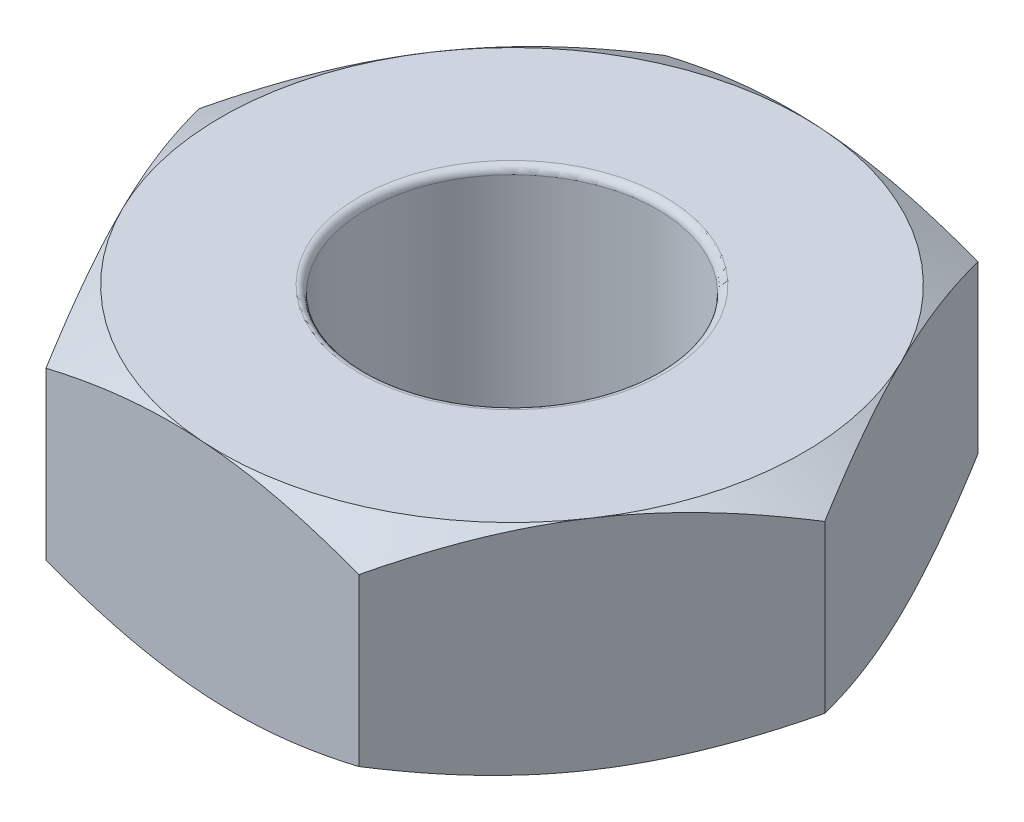
ISO-10303-21;
HEADER;
FILE_DESCRIPTION(('STEP AP214'),'2;1');
FILE_NAME('part.step','',(''),(''),'','','');
FILE_SCHEMA(('AUTOMOTIVE_DESIGN { 1 0 10303 214 1 1 1 1 }'));
ENDSEC;
DATA;
#1=APPLICATION_CONTEXT('core data for automotive mechanical design processes');
#2=APPLICATION_PROTOCOL_DEFINITION('international standard','automotive_design',2000,#1);
#3=PRODUCT_CONTEXT('',#1,'mechanical');
#4=PRODUCT('Part','Part','',(#3));
#5=PRODUCT_RELATED_PRODUCT_CATEGORY('part','',(#4));
#6=PRODUCT_DEFINITION_FORMATION('','',#4);
#7=PRODUCT_DEFINITION_CONTEXT('part definition',#1,'design');
#8=PRODUCT_DEFINITION('design','',#6,#7);
#9=PRODUCT_DEFINITION_SHAPE('','',#8);
#10=(LENGTH_UNIT() NAMED_UNIT(*) SI_UNIT(.MILLI.,.METRE.));
#11=(NAMED_UNIT(*) PLANE_ANGLE_UNIT() SI_UNIT($,.RADIAN.));
#12=(NAMED_UNIT(*) SI_UNIT($,.STERADIAN.) SOLID_ANGLE_UNIT());
#13=UNCERTAINTY_MEASURE_WITH_UNIT(LENGTH_MEASURE(1.E-05),#10,'distance_accuracy_value','');
#14=(GEOMETRIC_REPRESENTATION_CONTEXT(3) GLOBAL_UNCERTAINTY_ASSIGNED_CONTEXT((#13)) GLOBAL_UNIT_ASSIGNED_CONTEXT((#10,
#11,#12)) REPRESENTATION_CONTEXT('',''));
#15=CARTESIAN_POINT('',(0.,0.,0.));
#16=DIRECTION('',(0.,0.,1.));
#17=DIRECTION('',(1.,0.,0.));
#18=AXIS2_PLACEMENT_3D('',#15,#16,#17);
#19=CARTESIAN_POINT('',(-1.01889145115378,1.5,-2.07248487186254));
#20=DIRECTION('',(0.830790431180641,0.,0.556585356848961));
#21=DIRECTION('',(0.556585356848961,0.,-0.830790431180641));
#22=AXIS2_PLACEMENT_3D('',#19,#20,#21);
#23=PLANE('',#22);
#24=CARTESIAN_POINT('',(-2.3044042629206,0.17870229447922,-0.153656555533305));
#25=CARTESIAN_POINT('',(-2.24791738690639,0.149392131732598,-0.237972025752594));
#26=CARTESIAN_POINT('',(-2.19094292197888,0.122735200947277,-0.32301529845274));
#27=CARTESIAN_POINT('',(-2.07600733306594,0.0762043280336535,-0.494574586342692));
#28=CARTESIAN_POINT('',(-2.01804416619686,0.0563468484288385,-0.581093650854886));
#29=CARTESIAN_POINT('',(-1.90283620884368,0.0254345122474909,-0.753059491111205));
#30=CARTESIAN_POINT('',(-1.84560914882281,0.0141739393697929,-0.838479801374307));
#31=CARTESIAN_POINT('',(-1.73088563126617,0.000728946954070537,-1.00972253969756));
#32=CARTESIAN_POINT('',(-1.67338959097216,-0.00146660385901551,-1.09554434495932));
#33=CARTESIAN_POINT('',(-1.56594674731313,0.00309064611007184,-1.25591954224462));
#34=CARTESIAN_POINT('',(-1.51598389446592,0.00872448434658641,-1.33049689062285));
#35=CARTESIAN_POINT('',(-1.41638371049122,0.0265836323047187,-1.47916569545537));
#36=CARTESIAN_POINT('',(-1.36674672409494,0.0388150480780434,-1.55325663734456));
#37=CARTESIAN_POINT('',(-1.26694103244785,0.0693938952955361,-1.70223219442209));
#38=CARTESIAN_POINT('',(-1.21678496505558,0.0878710038893823,-1.77709794563597));
#39=CARTESIAN_POINT('',(-1.11722107773823,0.129807255614723,-1.9257125720478));
#40=CARTESIAN_POINT('',(-1.0678119813515,0.153256539361942,-1.99946335256378));
#41=CARTESIAN_POINT('',(-1.01875746180196,0.17870229447922,-2.07268487186254));
#42=B_SPLINE_CURVE_WITH_KNOTS('',3,(#24,#25,#26,#27,#28,#29,#30,#31,#32,#33,#34,#35,#36,#37,#38,
#39,#40,#41),.UNSPECIFIED.,.F.,.F.,(4,2,2,2,2,2,2,2,4),(0.,0.317032495401926,0.634827236126451,
0.944755934056078,1.25430394571055,1.52387737299583,1.79370071938297,2.06951074204568,
2.34477888847632),.UNSPECIFIED.);
#43=CARTESIAN_POINT('',(-2.30427027356878,0.178632794954081,-0.153856555533305));
#44=VERTEX_POINT('',#43);
#45=CARTESIAN_POINT('',(-1.66158086236128,0.,-1.11317071369792));
#46=VERTEX_POINT('',#45);
#47=EDGE_CURVE('E67',#44,#46,#42,.T.);
#48=ORIENTED_EDGE('',*,*,#47,.F.);
#49=DIRECTION('',(0.,-1.,0.));
#50=VECTOR('',#49,1.);
#51=CARTESIAN_POINT('',(-2.30427027356878,1.5,-0.153856555533305));
#52=LINE('',#51,#50);
#53=CARTESIAN_POINT('',(-2.30427027356878,1.32136720504592,-0.153856555533305));
#54=VERTEX_POINT('',#53);
#55=EDGE_CURVE('E301',#54,#44,#52,.T.);
#56=ORIENTED_EDGE('',*,*,#55,.F.);
#57=CARTESIAN_POINT('',(-1.01875746180196,1.32129770552078,-2.07268487186254));
#58=CARTESIAN_POINT('',(-1.07524433781617,1.3506078682674,-1.98836940164325));
#59=CARTESIAN_POINT('',(-1.13221880274368,1.37726479905272,-1.9033261289431));
#60=CARTESIAN_POINT('',(-1.24715439165662,1.42379567196635,-1.73176684105315));
#61=CARTESIAN_POINT('',(-1.3051175585257,1.44365315157116,-1.64524777654096));
#62=CARTESIAN_POINT('',(-1.42032551587889,1.47456548775251,-1.47328193628464));
#63=CARTESIAN_POINT('',(-1.47755257589975,1.48582606063021,-1.38786162602154));
#64=CARTESIAN_POINT('',(-1.59227609345639,1.49927105304593,-1.21661888769829));
#65=CARTESIAN_POINT('',(-1.6497721337504,1.50146660385902,-1.13079708243652));
#66=CARTESIAN_POINT('',(-1.75721497740943,1.49690935388993,-0.970421885151226));
#67=CARTESIAN_POINT('',(-1.80717783025664,1.49127551565341,-0.895844536772995));
#68=CARTESIAN_POINT('',(-1.90677801423135,1.47341636769528,-0.747175731940476));
#69=CARTESIAN_POINT('',(-1.95641500062762,1.46118495192196,-0.673084790051286));
#70=CARTESIAN_POINT('',(-2.05622069227472,1.43060610470446,-0.524109232973755));
#71=CARTESIAN_POINT('',(-2.10637675966698,1.41212899611062,-0.449243481759878));
#72=CARTESIAN_POINT('',(-2.20594064698433,1.37019274438528,-0.300628855348047));
#73=CARTESIAN_POINT('',(-2.25534974337106,1.34674346063806,-0.22687807483206));
#74=CARTESIAN_POINT('',(-2.3044042629206,1.32129770552078,-0.153656555533305));
#75=B_SPLINE_CURVE_WITH_KNOTS('',3,(#57,#58,#59,#60,#61,#62,#63,#64,#65,#66,#67,#68,#69,#70,#71,
#72,#73,#74),.UNSPECIFIED.,.F.,.F.,(4,2,2,2,2,2,2,2,4),(0.,0.317032495401926,0.634827236126451,
0.944755934056078,1.25430394571055,1.52387737299583,1.79370071938297,2.06951074204568,
2.34477888847632),.UNSPECIFIED.);
#76=CARTESIAN_POINT('',(-1.66158086236128,1.5,-1.11317071369792));
#77=VERTEX_POINT('',#76);
#78=EDGE_CURVE('E281',#77,#54,#75,.T.);
#79=ORIENTED_EDGE('',*,*,#78,.F.);
#80=CARTESIAN_POINT('',(-1.01889145115378,1.32136720504592,-2.07248487186254));
#81=VERTEX_POINT('',#80);
#82=EDGE_CURVE('E287',#81,#77,#75,.T.);
#83=ORIENTED_EDGE('',*,*,#82,.F.);
#84=DIRECTION('',(0.,-1.,0.));
#85=VECTOR('',#84,1.);
#86=CARTESIAN_POINT('',(-1.01889145115378,1.5,-2.07248487186254));
#87=LINE('',#86,#85);
#88=CARTESIAN_POINT('',(-1.01889145115378,0.178632794954081,-2.07248487186254));
#89=VERTEX_POINT('',#88);
#90=EDGE_CURVE('E289',#81,#89,#87,.T.);
#91=ORIENTED_EDGE('',*,*,#90,.T.);
#92=EDGE_CURVE('E182',#46,#89,#42,.T.);
#93=ORIENTED_EDGE('',*,*,#92,.F.);
#94=EDGE_LOOP('',(#48,#56,#79,#83,#91,#93));
#95=FACE_BOUND('',#94,.T.);
#96=ADVANCED_FACE('F44',(#95),#23,.F.);
#97=CARTESIAN_POINT('',(-2.30427027356878,1.5,-0.153856555533305));
#98=DIRECTION('',(0.897412273995947,0.,-0.441192940198982));
#99=DIRECTION('',(-0.441192940198982,0.,-0.897412273995948));
#100=AXIS2_PLACEMENT_3D('',#97,#98,#99);
#101=PLANE('',#100);
#102=CARTESIAN_POINT('',(-1.28528049682865,0.178697134619441,1.91882831632923));
#103=CARTESIAN_POINT('',(-1.33005626488278,0.149387395607351,1.82775178230482));
#104=CARTESIAN_POINT('',(-1.37521853306385,0.122730914901557,1.73588908439103));
#105=CARTESIAN_POINT('',(-1.46632515914288,0.0762009761286628,1.55057287228482));
#106=CARTESIAN_POINT('',(-1.5122711363043,0.0563439799977001,1.45711606441569));
#107=CARTESIAN_POINT('',(-1.6035936553284,0.025432599611697,1.27136071341778));
#108=CARTESIAN_POINT('',(-1.64895614323008,0.0141725019713579,1.17909075686862));
#109=CARTESIAN_POINT('',(-1.73989464820186,0.000728428109246974,0.994116512938719));
#110=CARTESIAN_POINT('',(-1.78547033456643,-0.0014666789988339,0.90141289823239));
#111=CARTESIAN_POINT('',(-1.87063657506906,0.00309127237815013,0.728179778222175));
#112=CARTESIAN_POINT('',(-1.91023985538118,0.00872519658883831,0.64762438713508));
#113=CARTESIAN_POINT('',(-1.98918839151325,0.0265841121102571,0.48703844188631));
#114=CARTESIAN_POINT('',(-2.02853337410976,0.0388152085484475,0.407008443477135));
#115=CARTESIAN_POINT('',(-2.10764478788152,0.0693930588229366,0.246091195572109));
#116=CARTESIAN_POINT('',(-2.14740120233765,0.0878694769760539,0.165224320669449));
#117=CARTESIAN_POINT('',(-2.22632095251759,0.129804085459463,0.00469692773285772));
#118=CARTESIAN_POINT('',(-2.26548529992143,0.153252417709535,-0.0749656481175029));
#119=CARTESIAN_POINT('',(-2.30436859915514,0.17869713461944,-0.154056555533305));
#120=B_SPLINE_CURVE_WITH_KNOTS('',3,(#102,#103,#104,#105,#106,#107,#108,#109,#110,#111,#112,
#113,#114,#115,#116,#117,#118,#119),.UNSPECIFIED.,.F.,.F.,(4,2,2,2,2,2,2,2,4),(0.,
0.317031271595703,0.63482475500014,0.944752346052572,1.25429926418656,1.52386478275026,
1.79368019058361,2.06948185449797,2.34474170148875),.UNSPECIFIED.);
#121=CARTESIAN_POINT('',(-1.28537882241501,0.178632794954081,1.91862831632923));
#122=VERTEX_POINT('',#121);
#123=CARTESIAN_POINT('',(-1.7948245479919,0.,0.882385880397964));
#124=VERTEX_POINT('',#123);
#125=EDGE_CURVE('E172',#122,#124,#120,.T.);
#126=ORIENTED_EDGE('',*,*,#125,.F.);
#127=DIRECTION('',(0.,-1.,0.));
#128=VECTOR('',#127,1.);
#129=CARTESIAN_POINT('',(-1.28537882241501,1.5,1.91862831632923));
#130=LINE('',#129,#128);
#131=CARTESIAN_POINT('',(-1.28537882241501,1.32136720504592,1.91862831632923));
#132=VERTEX_POINT('',#131);
#133=EDGE_CURVE('E298',#132,#122,#130,.T.);
#134=ORIENTED_EDGE('',*,*,#133,.F.);
#135=CARTESIAN_POINT('',(-2.30436859915514,1.32130286538056,-0.154056555533305));
#136=CARTESIAN_POINT('',(-2.25959283110101,1.35061260439265,-0.0629800215088912));
#137=CARTESIAN_POINT('',(-2.21443056291994,1.37726908509844,0.0288826764049017));
#138=CARTESIAN_POINT('',(-2.12332393684091,1.42379902387134,0.214198888511105));
#139=CARTESIAN_POINT('',(-2.07737795967949,1.4436560200023,0.307655696380241));
#140=CARTESIAN_POINT('',(-1.98605544065539,1.4745674003883,0.493411047378148));
#141=CARTESIAN_POINT('',(-1.94069295275371,1.48582749802864,0.585681003927309));
#142=CARTESIAN_POINT('',(-1.84975444778193,1.49927157189075,0.770655247857208));
#143=CARTESIAN_POINT('',(-1.80417876141736,1.50146667899883,0.863358862563537));
#144=CARTESIAN_POINT('',(-1.71901252091473,1.49690872762185,1.03659198257375));
#145=CARTESIAN_POINT('',(-1.67940924060262,1.49127480341116,1.11714737366085));
#146=CARTESIAN_POINT('',(-1.60046070447054,1.47341588788974,1.27773331890962));
#147=CARTESIAN_POINT('',(-1.56111572187403,1.46118479145155,1.35776331731879));
#148=CARTESIAN_POINT('',(-1.48200430810227,1.43060694117706,1.51868056522382));
#149=CARTESIAN_POINT('',(-1.44224789364614,1.41213052302395,1.59954744012648));
#150=CARTESIAN_POINT('',(-1.3633281434662,1.37019591454054,1.76007483306307));
#151=CARTESIAN_POINT('',(-1.32416379606236,1.34674758229047,1.83973740891343));
#152=CARTESIAN_POINT('',(-1.28528049682865,1.32130286538056,1.91882831632923));
#153=B_SPLINE_CURVE_WITH_KNOTS('',3,(#135,#136,#137,#138,#139,#140,#141,#142,#143,#144,#145,
#146,#147,#148,#149,#150,#151,#152),.UNSPECIFIED.,.F.,.F.,(4,2,2,2,2,2,2,2,4),(0.,
0.317031271595703,0.634824755000139,0.944752346052571,1.25429926418656,1.52386478275026,
1.79368019058361,2.06948185449797,2.34474170148875),.UNSPECIFIED.);
#154=CARTESIAN_POINT('',(-1.7948245479919,1.5,0.882385880397964));
#155=VERTEX_POINT('',#154);
#156=EDGE_CURVE('E260',#155,#132,#153,.T.);
#157=ORIENTED_EDGE('',*,*,#156,.F.);
#158=EDGE_CURVE('E288',#54,#155,#153,.T.);
#159=ORIENTED_EDGE('',*,*,#158,.F.);
#160=ORIENTED_EDGE('',*,*,#55,.T.);
#161=EDGE_CURVE('E146',#124,#44,#120,.T.);
#162=ORIENTED_EDGE('',*,*,#161,.F.);
#163=EDGE_LOOP('',(#126,#134,#157,#159,#160,#162));
#164=FACE_BOUND('',#163,.T.);
#165=ADVANCED_FACE('F269',(#164),#101,.F.);
#166=CARTESIAN_POINT('',(-1.28537882241501,1.5,1.91862831632923));
#167=DIRECTION('',(0.0666218428153071,0.,-0.997778297047943));
#168=DIRECTION('',(-0.997778297047943,0.,-0.0666218428153071));
#169=AXIS2_PLACEMENT_3D('',#166,#167,#168);
#170=PLANE('',#169);
#171=CARTESIAN_POINT('',(1.01909145115378,0.178690662303247,2.07249822589981));
#172=CARTESIAN_POINT('',(0.917829352494562,0.149381454814434,2.06573693670362));
#173=CARTESIAN_POINT('',(0.81569316829451,0.122725538678633,2.05891728465299));
#174=CARTESIAN_POINT('',(0.609652105069073,0.0761967716707326,2.04515988446869));
#175=CARTESIAN_POINT('',(0.505743564246356,0.0563403819980083,2.03822189183611));
#176=CARTESIAN_POINT('',(0.299214270424286,0.0254302005380428,2.0244318924039));
#177=CARTESIAN_POINT('',(0.196625299446483,0.0141706990231682,2.01758200769575));
#178=CARTESIAN_POINT('',(-0.00903550238193889,0.000727777368869983,2.00384999763578));
#179=CARTESIAN_POINT('',(-0.112106585419752,-0.00146677316922905,1.99696792221555));
#180=CARTESIAN_POINT('',(-0.30471020786291,0.00309205800416933,1.98410774245615));
#181=CARTESIAN_POINT('',(-0.3942715397437,0.00872609003739609,1.97812771563803));
#182=CARTESIAN_POINT('',(-0.572810695809223,0.0265847139710575,1.96620662291937));
#183=CARTESIAN_POINT('',(-0.661787902192491,0.0388154098397373,1.96026559826955));
#184=CARTESIAN_POINT('',(-0.840695346194219,0.0693920095804895,1.94831991489677));
#185=CARTESIAN_POINT('',(-0.930602933467215,0.0878675616733848,1.94231676854158));
#186=CARTESIAN_POINT('',(-1.10907694794356,0.129800108944276,1.93040002533897));
#187=CARTESIAN_POINT('',(-1.19764566270271,0.15324724767766,1.92448627575102));
#188=CARTESIAN_POINT('',(-1.28557882241501,0.178690662303247,1.91861496229197));
#189=B_SPLINE_CURVE_WITH_KNOTS('',3,(#171,#172,#173,#174,#175,#176,#177,#178,#179,#180,#181,
#182,#183,#184,#185,#186,#187,#188),.UNSPECIFIED.,.F.,.F.,(4,2,2,2,2,2,2,2,4),(0.,
0.317029736502206,0.634821642774693,0.944747845406166,1.25429339187313,1.52384898991189,
1.79365443980244,2.0694456187155,2.34469505509446),.UNSPECIFIED.);
#190=CARTESIAN_POINT('',(1.01889145115378,0.178632794954081,2.07248487186254));
#191=VERTEX_POINT('',#190);
#192=CARTESIAN_POINT('',(-0.133243685630614,0.,1.99555659409589));
#193=VERTEX_POINT('',#192);
#194=EDGE_CURVE('E155',#191,#193,#189,.T.);
#195=ORIENTED_EDGE('',*,*,#194,.F.);
#196=DIRECTION('',(0.,-1.,0.));
#197=VECTOR('',#196,1.);
#198=CARTESIAN_POINT('',(1.01889145115378,1.5,2.07248487186254));
#199=LINE('',#198,#197);
#200=CARTESIAN_POINT('',(1.01889145115378,1.32136720504592,2.07248487186254));
#201=VERTEX_POINT('',#200);
#202=EDGE_CURVE('E170',#201,#191,#199,.T.);
#203=ORIENTED_EDGE('',*,*,#202,.F.);
#204=CARTESIAN_POINT('',(-1.28557882241501,1.32130933769675,1.91861496229197));
#205=CARTESIAN_POINT('',(-1.18431672375579,1.35061854518557,1.92537625148815));
#206=CARTESIAN_POINT('',(-1.08218053955574,1.37727446132137,1.93219590353878));
#207=CARTESIAN_POINT('',(-0.876139476330302,1.42380322832927,1.94595330372308));
#208=CARTESIAN_POINT('',(-0.772230935507585,1.44365961800199,1.95289129635566));
#209=CARTESIAN_POINT('',(-0.565701641685515,1.47456979946196,1.96668129578787));
#210=CARTESIAN_POINT('',(-0.463112670707712,1.48582930097683,1.97353118049602));
#211=CARTESIAN_POINT('',(-0.25745186887929,1.49927222263113,1.98726319055599));
#212=CARTESIAN_POINT('',(-0.154380785841477,1.50146677316923,1.99414526597622));
#213=CARTESIAN_POINT('',(0.0382228366016809,1.49690794199583,2.00700544573562));
#214=CARTESIAN_POINT('',(0.127784168482471,1.4912739099626,2.01298547255375));
#215=CARTESIAN_POINT('',(0.306323324547994,1.47341528602894,2.0249065652724));
#216=CARTESIAN_POINT('',(0.395300530931262,1.46118459016026,2.03084758992222));
#217=CARTESIAN_POINT('',(0.57420797493299,1.43060799041951,2.042793273295));
#218=CARTESIAN_POINT('',(0.664115562205986,1.41213243832662,2.04879641965019));
#219=CARTESIAN_POINT('',(0.842589576682329,1.37019989105572,2.0607131628528));
#220=CARTESIAN_POINT('',(0.931158291441481,1.34675275232234,2.06662691244076));
#221=CARTESIAN_POINT('',(1.01909145115378,1.32130933769675,2.07249822589981));
#222=B_SPLINE_CURVE_WITH_KNOTS('',3,(#204,#205,#206,#207,#208,#209,#210,#211,#212,#213,#214,
#215,#216,#217,#218,#219,#220,#221),.UNSPECIFIED.,.F.,.F.,(4,2,2,2,2,2,2,2,4),(0.,
0.317029736502206,0.634821642774694,0.944747845406166,1.25429339187313,1.52384898991189,
1.79365443980244,2.0694456187155,2.34469505509446),.UNSPECIFIED.);
#223=CARTESIAN_POINT('',(-0.133243685630614,1.5,1.99555659409589));
#224=VERTEX_POINT('',#223);
#225=EDGE_CURVE('E253',#224,#201,#222,.T.);
#226=ORIENTED_EDGE('',*,*,#225,.F.);
#227=EDGE_CURVE('E259',#132,#224,#222,.T.);
#228=ORIENTED_EDGE('',*,*,#227,.F.);
#229=ORIENTED_EDGE('',*,*,#133,.T.);
#230=EDGE_CURVE('E171',#193,#122,#189,.T.);
#231=ORIENTED_EDGE('',*,*,#230,.F.);
#232=EDGE_LOOP('',(#195,#203,#226,#228,#229,#231));
#233=FACE_BOUND('',#232,.T.);
#234=ADVANCED_FACE('F266',(#233),#170,.F.);
#235=CARTESIAN_POINT('',(1.01889145115378,1.5,2.07248487186254));
#236=DIRECTION('',(-0.830790431180641,0.,-0.556585356848961));
#237=DIRECTION('',(-0.556585356848961,0.,0.830790431180641));
#238=AXIS2_PLACEMENT_3D('',#235,#236,#237);
#239=PLANE('',#238);
#240=CARTESIAN_POINT('',(2.3044042629206,0.17870229447922,0.153656555533305));
#241=CARTESIAN_POINT('',(2.24791738690639,0.149392131732598,0.237972025752593));
#242=CARTESIAN_POINT('',(2.19094292197888,0.122735200947276,0.32301529845274));
#243=CARTESIAN_POINT('',(2.07600733306594,0.0762043280336534,0.494574586342692));
#244=CARTESIAN_POINT('',(2.01804416619686,0.0563468484288386,0.581093650854885));
#245=CARTESIAN_POINT('',(1.90283620884368,0.0254345122474909,0.753059491111204));
#246=CARTESIAN_POINT('',(1.84560914882281,0.0141739393697926,0.838479801374306));
#247=CARTESIAN_POINT('',(1.73088563126617,0.000728946954070292,1.00972253969756));
#248=CARTESIAN_POINT('',(1.67338959097216,-0.00146660385901551,1.09554434495932));
#249=CARTESIAN_POINT('',(1.56594674731313,0.00309064611007183,1.25591954224462));
#250=CARTESIAN_POINT('',(1.51598389446592,0.00872448434658623,1.33049689062285));
#251=CARTESIAN_POINT('',(1.41638371049121,0.0265836323047185,1.47916569545537));
#252=CARTESIAN_POINT('',(1.36674672409494,0.0388150480780433,1.55325663734456));
#253=CARTESIAN_POINT('',(1.26694103244784,0.0693938952955362,1.70223219442209));
#254=CARTESIAN_POINT('',(1.21678496505558,0.0878710038893824,1.77709794563597));
#255=CARTESIAN_POINT('',(1.11722107773823,0.129807255614723,1.9257125720478));
#256=CARTESIAN_POINT('',(1.0678119813515,0.153256539361942,1.99946335256378));
#257=CARTESIAN_POINT('',(1.01875746180196,0.17870229447922,2.07268487186254));
#258=B_SPLINE_CURVE_WITH_KNOTS('',3,(#240,#241,#242,#243,#244,#245,#246,#247,#248,#249,#250,
#251,#252,#253,#254,#255,#256,#257),.UNSPECIFIED.,.F.,.F.,(4,2,2,2,2,2,2,2,4),(0.,
0.317032495401926,0.634827236126451,0.944755934056078,1.25430394571055,1.52387737299583,
1.79370071938297,2.06951074204568,2.34477888847632),.UNSPECIFIED.);
#259=CARTESIAN_POINT('',(2.30427027356878,0.178632794954081,0.153856555533305));
#260=VERTEX_POINT('',#259);
#261=CARTESIAN_POINT('',(1.66158086236128,0.,1.11317071369792));
#262=VERTEX_POINT('',#261);
#263=EDGE_CURVE('E134',#260,#262,#258,.T.);
#264=ORIENTED_EDGE('',*,*,#263,.F.);
#265=DIRECTION('',(0.,-1.,0.));
#266=VECTOR('',#265,1.);
#267=CARTESIAN_POINT('',(2.30427027356878,1.5,0.153856555533305));
#268=LINE('',#267,#266);
#269=CARTESIAN_POINT('',(2.30427027356878,1.32136720504592,0.153856555533305));
#270=VERTEX_POINT('',#269);
#271=EDGE_CURVE('E295',#270,#260,#268,.T.);
#272=ORIENTED_EDGE('',*,*,#271,.F.);
#273=CARTESIAN_POINT('',(1.01875746180196,1.32129770552078,2.07268487186254));
#274=CARTESIAN_POINT('',(1.07524433781617,1.3506078682674,1.98836940164325));
#275=CARTESIAN_POINT('',(1.13221880274368,1.37726479905272,1.9033261289431));
#276=CARTESIAN_POINT('',(1.24715439165662,1.42379567196635,1.73176684105315));
#277=CARTESIAN_POINT('',(1.3051175585257,1.44365315157116,1.64524777654096));
#278=CARTESIAN_POINT('',(1.42032551587889,1.47456548775251,1.47328193628464));
#279=CARTESIAN_POINT('',(1.47755257589975,1.48582606063021,1.38786162602154));
#280=CARTESIAN_POINT('',(1.59227609345639,1.49927105304593,1.21661888769829));
#281=CARTESIAN_POINT('',(1.6497721337504,1.50146660385902,1.13079708243652));
#282=CARTESIAN_POINT('',(1.75721497740943,1.49690935388993,0.970421885151226));
#283=CARTESIAN_POINT('',(1.80717783025664,1.49127551565341,0.895844536772995));
#284=CARTESIAN_POINT('',(1.90677801423135,1.47341636769528,0.747175731940476));
#285=CARTESIAN_POINT('',(1.95641500062762,1.46118495192196,0.673084790051286));
#286=CARTESIAN_POINT('',(2.05622069227472,1.43060610470446,0.524109232973755));
#287=CARTESIAN_POINT('',(2.10637675966698,1.41212899611062,0.449243481759878));
#288=CARTESIAN_POINT('',(2.20594064698433,1.37019274438528,0.300628855348046));
#289=CARTESIAN_POINT('',(2.25534974337106,1.34674346063806,0.226878074832059));
#290=CARTESIAN_POINT('',(2.3044042629206,1.32129770552078,0.153656555533305));
#291=B_SPLINE_CURVE_WITH_KNOTS('',3,(#273,#274,#275,#276,#277,#278,#279,#280,#281,#282,#283,
#284,#285,#286,#287,#288,#289,#290),.UNSPECIFIED.,.F.,.F.,(4,2,2,2,2,2,2,2,4),(0.,
0.317032495401926,0.634827236126452,0.944755934056078,1.25430394571055,1.52387737299583,
1.79370071938297,2.06951074204568,2.34477888847632),.UNSPECIFIED.);
#292=CARTESIAN_POINT('',(1.66158086236128,1.5,1.11317071369792));
#293=VERTEX_POINT('',#292);
#294=EDGE_CURVE('E246',#293,#270,#291,.T.);
#295=ORIENTED_EDGE('',*,*,#294,.F.);
#296=EDGE_CURVE('E252',#201,#293,#291,.T.);
#297=ORIENTED_EDGE('',*,*,#296,.F.);
#298=ORIENTED_EDGE('',*,*,#202,.T.);
#299=EDGE_CURVE('E148',#262,#191,#258,.T.);
#300=ORIENTED_EDGE('',*,*,#299,.F.);
#301=EDGE_LOOP('',(#264,#272,#295,#297,#298,#300));
#302=FACE_BOUND('',#301,.T.);
#303=ADVANCED_FACE('F167',(#302),#239,.F.);
#304=CARTESIAN_POINT('',(2.30427027356878,1.5,0.153856555533305));
#305=DIRECTION('',(-0.897412273995947,0.,0.441192940198982));
#306=DIRECTION('',(0.441192940198982,0.,0.897412273995948));
#307=AXIS2_PLACEMENT_3D('',#304,#305,#306);
#308=PLANE('',#307);
#309=CARTESIAN_POINT('',(1.28528049682865,0.178697134619441,-1.91882831632923));
#310=CARTESIAN_POINT('',(1.33005626488278,0.149387395607351,-1.82775178230482));
#311=CARTESIAN_POINT('',(1.37521853306385,0.122730914901557,-1.73588908439103));
#312=CARTESIAN_POINT('',(1.46632515914288,0.0762009761286628,-1.55057287228482));
#313=CARTESIAN_POINT('',(1.5122711363043,0.0563439799977,-1.45711606441569));
#314=CARTESIAN_POINT('',(1.6035936553284,0.025432599611697,-1.27136071341778));
#315=CARTESIAN_POINT('',(1.64895614323008,0.0141725019713581,-1.17909075686862));
#316=CARTESIAN_POINT('',(1.73989464820186,0.000728428109247289,-0.994116512938719));
#317=CARTESIAN_POINT('',(1.78547033456643,-0.00146667899883358,-0.90141289823239));
#318=CARTESIAN_POINT('',(1.87063657506906,0.00309127237815033,-0.728179778222175));
#319=CARTESIAN_POINT('',(1.91023985538118,0.00872519658883838,-0.647624387135081));
#320=CARTESIAN_POINT('',(1.98918839151325,0.026584112110257,-0.487038441886311));
#321=CARTESIAN_POINT('',(2.02853337410976,0.0388152085484475,-0.407008443477135));
#322=CARTESIAN_POINT('',(2.10764478788152,0.0693930588229366,-0.246091195572109));
#323=CARTESIAN_POINT('',(2.14740120233765,0.087869476976054,-0.16522432066945));
#324=CARTESIAN_POINT('',(2.22632095251759,0.129804085459463,-0.00469692773285803));
#325=CARTESIAN_POINT('',(2.26548529992143,0.153252417709535,0.0749656481175025));
#326=CARTESIAN_POINT('',(2.30436859915514,0.17869713461944,0.154056555533305));
#327=B_SPLINE_CURVE_WITH_KNOTS('',3,(#309,#310,#311,#312,#313,#314,#315,#316,#317,#318,#319,
#320,#321,#322,#323,#324,#325,#326),.UNSPECIFIED.,.F.,.F.,(4,2,2,2,2,2,2,2,4),(0.,
0.317031271595703,0.634824755000139,0.944752346052572,1.25429926418656,1.52386478275026,
1.79368019058361,2.06948185449797,2.34474170148875),.UNSPECIFIED.);
#328=CARTESIAN_POINT('',(1.28537882241501,0.178632794954081,-1.91862831632923));
#329=VERTEX_POINT('',#328);
#330=CARTESIAN_POINT('',(1.7948245479919,0.,-0.882385880397964));
#331=VERTEX_POINT('',#330);
#332=EDGE_CURVE('E59',#329,#331,#327,.T.);
#333=ORIENTED_EDGE('',*,*,#332,.F.);
#334=DIRECTION('',(0.,-1.,0.));
#335=VECTOR('',#334,1.);
#336=CARTESIAN_POINT('',(1.28537882241501,1.5,-1.91862831632923));
#337=LINE('',#336,#335);
#338=CARTESIAN_POINT('',(1.28537882241501,1.32136720504592,-1.91862831632923));
#339=VERTEX_POINT('',#338);
#340=EDGE_CURVE('E292',#339,#329,#337,.T.);
#341=ORIENTED_EDGE('',*,*,#340,.F.);
#342=CARTESIAN_POINT('',(2.30436859915514,1.32130286538056,0.154056555533305));
#343=CARTESIAN_POINT('',(2.25959283110101,1.35061260439265,0.0629800215088903));
#344=CARTESIAN_POINT('',(2.21443056291994,1.37726908509844,-0.0288826764049024));
#345=CARTESIAN_POINT('',(2.12332393684091,1.42379902387134,-0.214198888511106));
#346=CARTESIAN_POINT('',(2.07737795967949,1.4436560200023,-0.307655696380241));
#347=CARTESIAN_POINT('',(1.98605544065539,1.4745674003883,-0.493411047378148));
#348=CARTESIAN_POINT('',(1.94069295275371,1.48582749802864,-0.585681003927309));
#349=CARTESIAN_POINT('',(1.84975444778193,1.49927157189075,-0.770655247857209));
#350=CARTESIAN_POINT('',(1.80417876141736,1.50146667899883,-0.863358862563538));
#351=CARTESIAN_POINT('',(1.71901252091473,1.49690872762185,-1.03659198257375));
#352=CARTESIAN_POINT('',(1.67940924060262,1.49127480341116,-1.11714737366085));
#353=CARTESIAN_POINT('',(1.60046070447054,1.47341588788974,-1.27773331890962));
#354=CARTESIAN_POINT('',(1.56111572187403,1.46118479145155,-1.35776331731879));
#355=CARTESIAN_POINT('',(1.48200430810227,1.43060694117706,-1.51868056522382));
#356=CARTESIAN_POINT('',(1.44224789364614,1.41213052302395,-1.59954744012648));
#357=CARTESIAN_POINT('',(1.3633281434662,1.37019591454054,-1.76007483306307));
#358=CARTESIAN_POINT('',(1.32416379606236,1.34674758229047,-1.83973740891343));
#359=CARTESIAN_POINT('',(1.28528049682865,1.32130286538056,-1.91882831632923));
#360=B_SPLINE_CURVE_WITH_KNOTS('',3,(#342,#343,#344,#345,#346,#347,#348,#349,#350,#351,#352,
#353,#354,#355,#356,#357,#358,#359),.UNSPECIFIED.,.F.,.F.,(4,2,2,2,2,2,2,2,4),(0.,
0.317031271595703,0.634824755000139,0.944752346052571,1.25429926418656,1.52386478275026,
1.79368019058361,2.06948185449797,2.34474170148875),.UNSPECIFIED.);
#361=CARTESIAN_POINT('',(1.7948245479919,1.5,-0.882385880397964));
#362=VERTEX_POINT('',#361);
#363=EDGE_CURVE('E238',#362,#339,#360,.T.);
#364=ORIENTED_EDGE('',*,*,#363,.F.);
#365=EDGE_CURVE('E244',#270,#362,#360,.T.);
#366=ORIENTED_EDGE('',*,*,#365,.F.);
#367=ORIENTED_EDGE('',*,*,#271,.T.);
#368=EDGE_CURVE('E141',#331,#260,#327,.T.);
#369=ORIENTED_EDGE('',*,*,#368,.F.);
#370=EDGE_LOOP('',(#333,#341,#364,#366,#367,#369));
#371=FACE_BOUND('',#370,.T.);
#372=ADVANCED_FACE('F229',(#371),#308,.F.);
#373=CARTESIAN_POINT('',(1.28537882241501,1.5,-1.91862831632923));
#374=DIRECTION('',(-0.0666218428153071,0.,0.997778297047943));
#375=DIRECTION('',(0.997778297047943,0.,0.0666218428153071));
#376=AXIS2_PLACEMENT_3D('',#373,#374,#375);
#377=PLANE('',#376);
#378=CARTESIAN_POINT('',(-1.01909145115378,0.178690662303247,-2.07249822589981));
#379=CARTESIAN_POINT('',(-0.917829352494563,0.149381454814433,-2.06573693670362));
#380=CARTESIAN_POINT('',(-0.81569316829451,0.122725538678632,-2.05891728465299));
#381=CARTESIAN_POINT('',(-0.609652105069073,0.0761967716707327,-2.04515988446869));
#382=CARTESIAN_POINT('',(-0.505743564246356,0.0563403819980085,-2.03822189183611));
#383=CARTESIAN_POINT('',(-0.299214270424286,0.0254302005380431,-2.0244318924039));
#384=CARTESIAN_POINT('',(-0.196625299446483,0.0141706990231684,-2.01758200769575));
#385=CARTESIAN_POINT('',(0.00903550238193844,0.000727777368869854,-2.00384999763578));
#386=CARTESIAN_POINT('',(0.112106585419752,-0.00146677316922933,-1.99696792221555));
#387=CARTESIAN_POINT('',(0.30471020786291,0.00309205800416912,-1.98410774245615));
#388=CARTESIAN_POINT('',(0.394271539743699,0.00872609003739608,-1.97812771563803));
#389=CARTESIAN_POINT('',(0.572810695809223,0.0265847139710575,-1.96620662291937));
#390=CARTESIAN_POINT('',(0.661787902192491,0.0388154098397371,-1.96026559826955));
#391=CARTESIAN_POINT('',(0.840695346194219,0.0693920095804893,-1.94831991489677));
#392=CARTESIAN_POINT('',(0.930602933467215,0.0878675616733847,-1.94231676854158));
#393=CARTESIAN_POINT('',(1.10907694794356,0.129800108944276,-1.93040002533897));
#394=CARTESIAN_POINT('',(1.19764566270271,0.15324724767766,-1.92448627575102));
#395=CARTESIAN_POINT('',(1.28557882241501,0.178690662303247,-1.91861496229197));
#396=B_SPLINE_CURVE_WITH_KNOTS('',3,(#378,#379,#380,#381,#382,#383,#384,#385,#386,#387,#388,
#389,#390,#391,#392,#393,#394,#395),.UNSPECIFIED.,.F.,.F.,(4,2,2,2,2,2,2,2,4),(0.,
0.317029736502206,0.634821642774693,0.944747845406166,1.25429339187313,1.52384898991189,
1.79365443980244,2.0694456187155,2.34469505509446),.UNSPECIFIED.);
#397=CARTESIAN_POINT('',(0.133243685630614,0.,-1.99555659409588));
#398=VERTEX_POINT('',#397);
#399=EDGE_CURVE('E228',#89,#398,#396,.T.);
#400=ORIENTED_EDGE('',*,*,#399,.F.);
#401=ORIENTED_EDGE('',*,*,#90,.F.);
#402=CARTESIAN_POINT('',(1.28557882241501,1.32130933769675,-1.91861496229197));
#403=CARTESIAN_POINT('',(1.18431672375579,1.35061854518557,-1.92537625148815));
#404=CARTESIAN_POINT('',(1.08218053955574,1.37727446132137,-1.93219590353878));
#405=CARTESIAN_POINT('',(0.876139476330302,1.42380322832927,-1.94595330372308));
#406=CARTESIAN_POINT('',(0.772230935507585,1.44365961800199,-1.95289129635566));
#407=CARTESIAN_POINT('',(0.565701641685515,1.47456979946196,-1.96668129578787));
#408=CARTESIAN_POINT('',(0.463112670707712,1.48582930097683,-1.97353118049602));
#409=CARTESIAN_POINT('',(0.25745186887929,1.49927222263113,-1.98726319055599));
#410=CARTESIAN_POINT('',(0.154380785841477,1.50146677316923,-1.99414526597622));
#411=CARTESIAN_POINT('',(-0.0382228366016809,1.49690794199583,-2.00700544573562));
#412=CARTESIAN_POINT('',(-0.127784168482471,1.4912739099626,-2.01298547255375));
#413=CARTESIAN_POINT('',(-0.306323324547994,1.47341528602894,-2.0249065652724));
#414=CARTESIAN_POINT('',(-0.395300530931262,1.46118459016026,-2.03084758992222));
#415=CARTESIAN_POINT('',(-0.574207974932991,1.43060799041951,-2.042793273295));
#416=CARTESIAN_POINT('',(-0.664115562205986,1.41213243832662,-2.04879641965019));
#417=CARTESIAN_POINT('',(-0.84258957668233,1.37019989105572,-2.0607131628528));
#418=CARTESIAN_POINT('',(-0.931158291441482,1.34675275232234,-2.06662691244076));
#419=CARTESIAN_POINT('',(-1.01909145115378,1.32130933769675,-2.07249822589981));
#420=B_SPLINE_CURVE_WITH_KNOTS('',3,(#402,#403,#404,#405,#406,#407,#408,#409,#410,#411,#412,
#413,#414,#415,#416,#417,#418,#419),.UNSPECIFIED.,.F.,.F.,(4,2,2,2,2,2,2,2,4),(0.,
0.317029736502206,0.634821642774694,0.944747845406166,1.25429339187313,1.52384898991189,
1.79365443980244,2.0694456187155,2.34469505509446),.UNSPECIFIED.);
#421=CARTESIAN_POINT('',(0.133243685630614,1.5,-1.99555659409589));
#422=VERTEX_POINT('',#421);
#423=EDGE_CURVE('E304',#422,#81,#420,.T.);
#424=ORIENTED_EDGE('',*,*,#423,.F.);
#425=EDGE_CURVE('E160',#339,#422,#420,.T.);
#426=ORIENTED_EDGE('',*,*,#425,.F.);
#427=ORIENTED_EDGE('',*,*,#340,.T.);
#428=EDGE_CURVE('E216',#398,#329,#396,.T.);
#429=ORIENTED_EDGE('',*,*,#428,.F.);
#430=EDGE_LOOP('',(#400,#401,#424,#426,#427,#429));
#431=FACE_BOUND('',#430,.T.);
#432=ADVANCED_FACE('F232',(#431),#377,.F.);
#433=CARTESIAN_POINT('',(0.,0.,0.));
#434=DIRECTION('',(0.,1.,0.));
#435=DIRECTION('',(0.,0.,1.));
#436=AXIS2_PLACEMENT_3D('',#433,#434,#435);
#437=PLANE('',#436);
#438=CARTESIAN_POINT('',(0.,0.,0.));
#439=DIRECTION('',(0.,1.,0.));
#440=DIRECTION('',(0.,0.,1.));
#441=AXIS2_PLACEMENT_3D('',#438,#439,#440);
#442=CIRCLE('',#441,1.05);
#443=CARTESIAN_POINT('',(0.,0.,1.05));
#444=VERTEX_POINT('',#443);
#445=EDGE_CURVE('E164',#444,#444,#442,.T.);
#446=ORIENTED_EDGE('',*,*,#445,.T.);
#447=EDGE_LOOP('',(#446));
#448=FACE_BOUND('',#447,.T.);
#449=CARTESIAN_POINT('',(0.,0.,0.));
#450=DIRECTION('',(0.,1.,0.));
#451=DIRECTION('',(0.,0.,1.));
#452=AXIS2_PLACEMENT_3D('',#449,#450,#451);
#453=CIRCLE('',#452,2.);
#454=EDGE_CURVE('E138',#262,#331,#453,.T.);
#455=ORIENTED_EDGE('',*,*,#454,.F.);
#456=EDGE_CURVE('E152',#193,#262,#453,.T.);
#457=ORIENTED_EDGE('',*,*,#456,.F.);
#458=EDGE_CURVE('E159',#124,#193,#453,.T.);
#459=ORIENTED_EDGE('',*,*,#458,.F.);
#460=EDGE_CURVE('E395',#46,#124,#453,.T.);
#461=ORIENTED_EDGE('',*,*,#460,.F.);
#462=EDGE_CURVE('E165',#398,#46,#453,.T.);
#463=ORIENTED_EDGE('',*,*,#462,.F.);
#464=CARTESIAN_POINT('',(0.,0.,0.));
#465=DIRECTION('',(0.,-1.,0.));
#466=DIRECTION('',(0.,0.,-1.));
#467=AXIS2_PLACEMENT_3D('',#464,#465,#466);
#468=CIRCLE('',#467,2.);
#469=EDGE_CURVE('E163',#398,#331,#468,.T.);
#470=ORIENTED_EDGE('',*,*,#469,.T.);
#471=EDGE_LOOP('',(#455,#457,#459,#461,#463,#470));
#472=FACE_BOUND('',#471,.T.);
#473=ADVANCED_FACE('F162',(#448,#472),#437,.F.);
#474=CARTESIAN_POINT('',(0.,1.5,0.));
#475=DIRECTION('',(0.,1.,0.));
#476=DIRECTION('',(0.,0.,1.));
#477=AXIS2_PLACEMENT_3D('',#474,#475,#476);
#478=PLANE('',#477);
#479=CARTESIAN_POINT('',(0.,1.5,0.));
#480=DIRECTION('',(0.,1.,0.));
#481=DIRECTION('',(0.,0.,1.));
#482=AXIS2_PLACEMENT_3D('',#479,#480,#481);
#483=CIRCLE('',#482,1.05);
#484=CARTESIAN_POINT('',(0.,1.5,1.05));
#485=VERTEX_POINT('',#484);
#486=EDGE_CURVE('E12',#485,#485,#483,.F.);
#487=ORIENTED_EDGE('',*,*,#486,.T.);
#488=EDGE_LOOP('',(#487));
#489=FACE_BOUND('',#488,.T.);
#490=CARTESIAN_POINT('',(0.,1.5,0.));
#491=DIRECTION('',(0.,1.,0.));
#492=DIRECTION('',(0.,0.,1.));
#493=AXIS2_PLACEMENT_3D('',#490,#491,#492);
#494=CIRCLE('',#493,2.);
#495=EDGE_CURVE('E385',#224,#293,#494,.T.);
#496=ORIENTED_EDGE('',*,*,#495,.T.);
#497=EDGE_CURVE('E245',#293,#362,#494,.T.);
#498=ORIENTED_EDGE('',*,*,#497,.T.);
#499=EDGE_CURVE('E381',#362,#422,#494,.T.);
#500=ORIENTED_EDGE('',*,*,#499,.T.);
#501=EDGE_CURVE('E375',#422,#77,#494,.T.);
#502=ORIENTED_EDGE('',*,*,#501,.T.);
#503=EDGE_CURVE('E358',#77,#155,#494,.T.);
#504=ORIENTED_EDGE('',*,*,#503,.T.);
#505=EDGE_CURVE('E386',#155,#224,#494,.T.);
#506=ORIENTED_EDGE('',*,*,#505,.T.);
#507=EDGE_LOOP('',(#496,#498,#500,#502,#504,#506));
#508=FACE_BOUND('',#507,.T.);
#509=ADVANCED_FACE('F325',(#489,#508),#478,.T.);
#510=CARTESIAN_POINT('',(0.,1.5,0.));
#511=DIRECTION('',(0.,-1.,0.));
#512=DIRECTION('',(0.,0.,-1.));
#513=AXIS2_PLACEMENT_3D('',#510,#511,#512);
#514=CYLINDRICAL_SURFACE('',#513,1.);
#515=CARTESIAN_POINT('',(0.,0.0499999999999999,0.));
#516=DIRECTION('',(0.,1.,0.));
#517=DIRECTION('',(0.,0.,1.));
#518=AXIS2_PLACEMENT_3D('',#515,#516,#517);
#519=CIRCLE('',#518,1.);
#520=CARTESIAN_POINT('',(0.,0.0499999999999999,1.));
#521=VERTEX_POINT('',#520);
#522=EDGE_CURVE('E52',#521,#521,#519,.F.);
#523=ORIENTED_EDGE('',*,*,#522,.T.);
#524=EDGE_LOOP('',(#523));
#525=FACE_BOUND('',#524,.T.);
#526=CARTESIAN_POINT('',(0.,1.45,0.));
#527=DIRECTION('',(0.,1.,0.));
#528=DIRECTION('',(0.,0.,1.));
#529=AXIS2_PLACEMENT_3D('',#526,#527,#528);
#530=CIRCLE('',#529,1.);
#531=CARTESIAN_POINT('',(0.,1.45,1.));
#532=VERTEX_POINT('',#531);
#533=EDGE_CURVE('E312',#532,#532,#530,.T.);
#534=ORIENTED_EDGE('',*,*,#533,.T.);
#535=EDGE_LOOP('',(#534));
#536=FACE_BOUND('',#535,.T.);
#537=ADVANCED_FACE('F317',(#525,#536),#514,.F.);
#538=CARTESIAN_POINT('',(0.,1.5,0.));
#539=DIRECTION('',(0.,-1.,0.));
#540=DIRECTION('',(0.,0.,1.));
#541=AXIS2_PLACEMENT_3D('',#538,#539,#540);
#542=CONICAL_SURFACE('',#541,2.,1.0471975511966);
#543=ORIENTED_EDGE('',*,*,#82,.T.);
#544=ORIENTED_EDGE('',*,*,#501,.F.);
#545=ORIENTED_EDGE('',*,*,#423,.T.);
#546=EDGE_LOOP('',(#543,#544,#545));
#547=FACE_BOUND('',#546,.T.);
#548=ADVANCED_FACE('F203',(#547),#542,.T.);
#549=ORIENTED_EDGE('',*,*,#363,.T.);
#550=ORIENTED_EDGE('',*,*,#425,.T.);
#551=ORIENTED_EDGE('',*,*,#499,.F.);
#552=EDGE_LOOP('',(#549,#550,#551));
#553=FACE_BOUND('',#552,.T.);
#554=ADVANCED_FACE('F337',(#553),#542,.T.);
#555=ORIENTED_EDGE('',*,*,#294,.T.);
#556=ORIENTED_EDGE('',*,*,#365,.T.);
#557=ORIENTED_EDGE('',*,*,#497,.F.);
#558=EDGE_LOOP('',(#555,#556,#557));
#559=FACE_BOUND('',#558,.T.);
#560=ADVANCED_FACE('F342',(#559),#542,.T.);
#561=ORIENTED_EDGE('',*,*,#225,.T.);
#562=ORIENTED_EDGE('',*,*,#296,.T.);
#563=ORIENTED_EDGE('',*,*,#495,.F.);
#564=EDGE_LOOP('',(#561,#562,#563));
#565=FACE_BOUND('',#564,.T.);
#566=ADVANCED_FACE('F351',(#565),#542,.T.);
#567=ORIENTED_EDGE('',*,*,#156,.T.);
#568=ORIENTED_EDGE('',*,*,#227,.T.);
#569=ORIENTED_EDGE('',*,*,#505,.F.);
#570=EDGE_LOOP('',(#567,#568,#569));
#571=FACE_BOUND('',#570,.T.);
#572=ADVANCED_FACE('F346',(#571),#542,.T.);
#573=ORIENTED_EDGE('',*,*,#78,.T.);
#574=ORIENTED_EDGE('',*,*,#158,.T.);
#575=ORIENTED_EDGE('',*,*,#503,.F.);
#576=EDGE_LOOP('',(#573,#574,#575));
#577=FACE_BOUND('',#576,.T.);
#578=ADVANCED_FACE('F201',(#577),#542,.T.);
#579=CARTESIAN_POINT('',(0.,0.,0.));
#580=DIRECTION('',(0.,1.,0.));
#581=DIRECTION('',(0.,0.,-1.));
#582=AXIS2_PLACEMENT_3D('',#579,#580,#581);
#583=CONICAL_SURFACE('',#582,2.,1.0471975511966);
#584=ORIENTED_EDGE('',*,*,#194,.T.);
#585=ORIENTED_EDGE('',*,*,#456,.T.);
#586=ORIENTED_EDGE('',*,*,#299,.T.);
#587=EDGE_LOOP('',(#584,#585,#586));
#588=FACE_BOUND('',#587,.T.);
#589=ADVANCED_FACE('F153',(#588),#583,.T.);
#590=ORIENTED_EDGE('',*,*,#230,.T.);
#591=ORIENTED_EDGE('',*,*,#125,.T.);
#592=ORIENTED_EDGE('',*,*,#458,.T.);
#593=EDGE_LOOP('',(#590,#591,#592));
#594=FACE_BOUND('',#593,.T.);
#595=ADVANCED_FACE('F200',(#594),#583,.T.);
#596=ORIENTED_EDGE('',*,*,#161,.T.);
#597=ORIENTED_EDGE('',*,*,#47,.T.);
#598=ORIENTED_EDGE('',*,*,#460,.T.);
#599=EDGE_LOOP('',(#596,#597,#598));
#600=FACE_BOUND('',#599,.T.);
#601=ADVANCED_FACE('F394',(#600),#583,.T.);
#602=ORIENTED_EDGE('',*,*,#92,.T.);
#603=ORIENTED_EDGE('',*,*,#399,.T.);
#604=ORIENTED_EDGE('',*,*,#462,.T.);
#605=EDGE_LOOP('',(#602,#603,#604));
#606=FACE_BOUND('',#605,.T.);
#607=ADVANCED_FACE('F369',(#606),#583,.T.);
#608=ORIENTED_EDGE('',*,*,#332,.T.);
#609=ORIENTED_EDGE('',*,*,#469,.F.);
#610=ORIENTED_EDGE('',*,*,#428,.T.);
#611=EDGE_LOOP('',(#608,#609,#610));
#612=FACE_BOUND('',#611,.T.);
#613=ADVANCED_FACE('F202',(#612),#583,.T.);
#614=ORIENTED_EDGE('',*,*,#263,.T.);
#615=ORIENTED_EDGE('',*,*,#454,.T.);
#616=ORIENTED_EDGE('',*,*,#368,.T.);
#617=EDGE_LOOP('',(#614,#615,#616));
#618=FACE_BOUND('',#617,.T.);
#619=ADVANCED_FACE('F136',(#618),#583,.T.);
#620=CARTESIAN_POINT('',(0.,0.0499999999999999,0.));
#621=DIRECTION('',(0.,1.,0.));
#622=DIRECTION('',(0.,0.,1.));
#623=AXIS2_PLACEMENT_3D('',#620,#621,#622);
#624=TOROIDAL_SURFACE('',#623,1.05,0.05);
#625=ORIENTED_EDGE('',*,*,#522,.F.);
#626=EDGE_LOOP('',(#625));
#627=FACE_BOUND('',#626,.T.);
#628=ORIENTED_EDGE('',*,*,#445,.F.);
#629=EDGE_LOOP('',(#628));
#630=FACE_BOUND('',#629,.T.);
#631=ADVANCED_FACE('F279',(#627,#630),#624,.T.);
#632=CARTESIAN_POINT('',(0.,1.45,0.));
#633=DIRECTION('',(0.,1.,0.));
#634=DIRECTION('',(0.,0.,1.));
#635=AXIS2_PLACEMENT_3D('',#632,#633,#634);
#636=TOROIDAL_SURFACE('',#635,1.05,0.05);
#637=ORIENTED_EDGE('',*,*,#486,.F.);
#638=EDGE_LOOP('',(#637));
#639=FACE_BOUND('',#638,.T.);
#640=ORIENTED_EDGE('',*,*,#533,.F.);
#641=EDGE_LOOP('',(#640));
#642=FACE_BOUND('',#641,.T.);
#643=ADVANCED_FACE('F46',(#639,#642),#636,.T.);
#644=CLOSED_SHELL('',(#96,#165,#234,#303,#372,#432,#473,#509,#537,#548,#554,#560,#566,#572,#578,
#589,#595,#601,#607,#613,#619,#631,#643));
#645=MANIFOLD_SOLID_BREP('B2',#644);
#646=ADVANCED_BREP_SHAPE_REPRESENTATION('',(#18,#645),#14);
#647=SHAPE_DEFINITION_REPRESENTATION(#9,#646);
ENDSEC;
END-ISO-10303-21;
